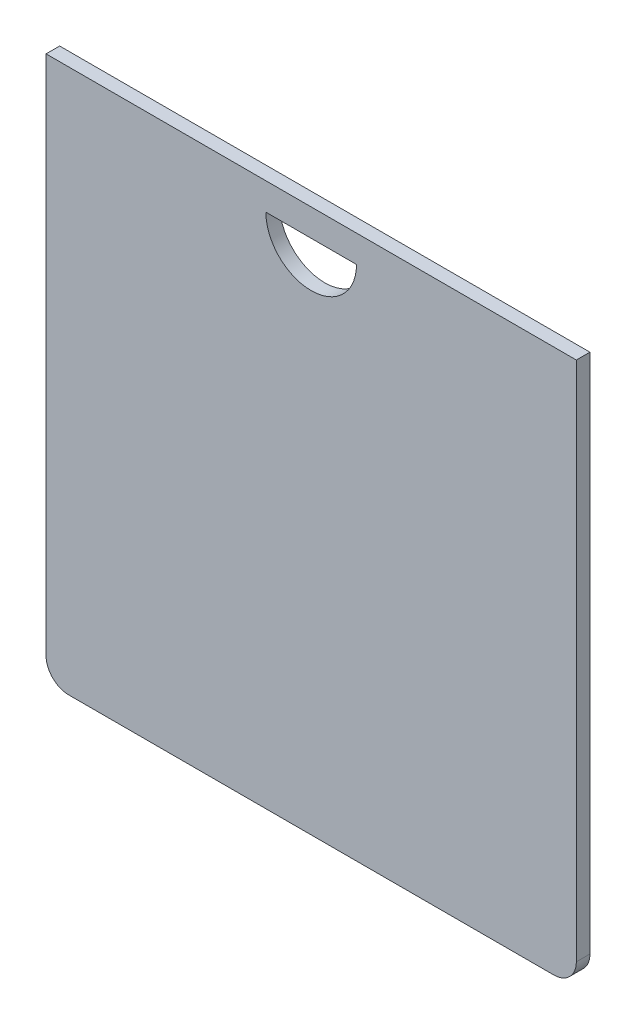
ISO-10303-21;
HEADER;
FILE_DESCRIPTION(('STEP AP214'),'2;1');
FILE_NAME('part.step','',(''),(''),'','','');
FILE_SCHEMA(('AUTOMOTIVE_DESIGN { 1 0 10303 214 1 1 1 1 }'));
ENDSEC;
DATA;
#1=APPLICATION_CONTEXT('core data for automotive mechanical design processes');
#2=APPLICATION_PROTOCOL_DEFINITION('international standard','automotive_design',2000,#1);
#3=PRODUCT_CONTEXT('',#1,'mechanical');
#4=PRODUCT('Part','Part','',(#3));
#5=PRODUCT_RELATED_PRODUCT_CATEGORY('part','',(#4));
#6=PRODUCT_DEFINITION_FORMATION('','',#4);
#7=PRODUCT_DEFINITION_CONTEXT('part definition',#1,'design');
#8=PRODUCT_DEFINITION('design','',#6,#7);
#9=PRODUCT_DEFINITION_SHAPE('','',#8);
#10=(LENGTH_UNIT() NAMED_UNIT(*) SI_UNIT(.MILLI.,.METRE.));
#11=(NAMED_UNIT(*) PLANE_ANGLE_UNIT() SI_UNIT($,.RADIAN.));
#12=(NAMED_UNIT(*) SI_UNIT($,.STERADIAN.) SOLID_ANGLE_UNIT());
#13=UNCERTAINTY_MEASURE_WITH_UNIT(LENGTH_MEASURE(1.E-05),#10,'distance_accuracy_value','');
#14=(GEOMETRIC_REPRESENTATION_CONTEXT(3) GLOBAL_UNCERTAINTY_ASSIGNED_CONTEXT((#13)) GLOBAL_UNIT_ASSIGNED_CONTEXT((#10,
#11,#12)) REPRESENTATION_CONTEXT('',''));
#15=CARTESIAN_POINT('',(0.,0.,0.));
#16=DIRECTION('',(0.,0.,1.));
#17=DIRECTION('',(1.,0.,0.));
#18=AXIS2_PLACEMENT_3D('',#15,#16,#17);
#19=CARTESIAN_POINT('',(0.,60.,1.5));
#20=DIRECTION('',(1.,0.,0.));
#21=DIRECTION('',(0.,1.,0.));
#22=AXIS2_PLACEMENT_3D('',#19,#20,#21);
#23=PLANE('',#22);
#24=DIRECTION('',(0.,-1.,0.));
#25=VECTOR('',#24,1.);
#26=CARTESIAN_POINT('',(0.,60.,0.));
#27=LINE('',#26,#25);
#28=CARTESIAN_POINT('',(0.,60.,0.));
#29=VERTEX_POINT('',#28);
#30=CARTESIAN_POINT('',(0.,2.5,0.));
#31=VERTEX_POINT('',#30);
#32=EDGE_CURVE('E113',#29,#31,#27,.T.);
#33=ORIENTED_EDGE('',*,*,#32,.T.);
#34=DIRECTION('',(0.,0.,-1.));
#35=VECTOR('',#34,1.);
#36=CARTESIAN_POINT('',(0.,2.5,1.5));
#37=LINE('',#36,#35);
#38=CARTESIAN_POINT('',(0.,2.5,1.5));
#39=VERTEX_POINT('',#38);
#40=EDGE_CURVE('E11',#31,#39,#37,.F.);
#41=ORIENTED_EDGE('',*,*,#40,.T.);
#42=DIRECTION('',(0.,-1.,0.));
#43=VECTOR('',#42,1.);
#44=CARTESIAN_POINT('',(0.,60.,1.5));
#45=LINE('',#44,#43);
#46=CARTESIAN_POINT('',(0.,60.,1.5));
#47=VERTEX_POINT('',#46);
#48=EDGE_CURVE('E115',#47,#39,#45,.T.);
#49=ORIENTED_EDGE('',*,*,#48,.F.);
#50=DIRECTION('',(0.,0.,-1.));
#51=VECTOR('',#50,1.);
#52=CARTESIAN_POINT('',(0.,60.,1.5));
#53=LINE('',#52,#51);
#54=EDGE_CURVE('E126',#47,#29,#53,.T.);
#55=ORIENTED_EDGE('',*,*,#54,.T.);
#56=EDGE_LOOP('',(#33,#41,#49,#55));
#57=FACE_BOUND('',#56,.T.);
#58=ADVANCED_FACE('F33',(#57),#23,.F.);
#59=CARTESIAN_POINT('',(0.,0.,1.5));
#60=DIRECTION('',(0.,1.,0.));
#61=DIRECTION('',(0.,0.,1.));
#62=AXIS2_PLACEMENT_3D('',#59,#60,#61);
#63=PLANE('',#62);
#64=DIRECTION('',(1.,0.,0.));
#65=VECTOR('',#64,1.);
#66=CARTESIAN_POINT('',(0.,0.,0.));
#67=LINE('',#66,#65);
#68=CARTESIAN_POINT('',(2.5,0.,0.));
#69=VERTEX_POINT('',#68);
#70=CARTESIAN_POINT('',(56.,0.,0.));
#71=VERTEX_POINT('',#70);
#72=EDGE_CURVE('E129',#69,#71,#67,.T.);
#73=ORIENTED_EDGE('',*,*,#72,.T.);
#74=DIRECTION('',(0.,0.,-1.));
#75=VECTOR('',#74,1.);
#76=CARTESIAN_POINT('',(56.,0.,1.5));
#77=LINE('',#76,#75);
#78=CARTESIAN_POINT('',(56.,0.,1.5));
#79=VERTEX_POINT('',#78);
#80=EDGE_CURVE('E150',#71,#79,#77,.F.);
#81=ORIENTED_EDGE('',*,*,#80,.T.);
#82=DIRECTION('',(1.,0.,0.));
#83=VECTOR('',#82,1.);
#84=CARTESIAN_POINT('',(0.,0.,1.5));
#85=LINE('',#84,#83);
#86=CARTESIAN_POINT('',(2.5,0.,1.5));
#87=VERTEX_POINT('',#86);
#88=EDGE_CURVE('E118',#87,#79,#85,.T.);
#89=ORIENTED_EDGE('',*,*,#88,.F.);
#90=DIRECTION('',(0.,0.,-1.));
#91=VECTOR('',#90,1.);
#92=CARTESIAN_POINT('',(2.5,0.,1.5));
#93=LINE('',#92,#91);
#94=EDGE_CURVE('E147',#87,#69,#93,.T.);
#95=ORIENTED_EDGE('',*,*,#94,.T.);
#96=EDGE_LOOP('',(#73,#81,#89,#95));
#97=FACE_BOUND('',#96,.T.);
#98=ADVANCED_FACE('F170',(#97),#63,.F.);
#99=CARTESIAN_POINT('',(58.5,60.,1.5));
#100=DIRECTION('',(-1.,0.,0.));
#101=DIRECTION('',(0.,-1.,0.));
#102=AXIS2_PLACEMENT_3D('',#99,#100,#101);
#103=PLANE('',#102);
#104=DIRECTION('',(0.,1.,0.));
#105=VECTOR('',#104,1.);
#106=CARTESIAN_POINT('',(58.5,60.,1.5));
#107=LINE('',#106,#105);
#108=CARTESIAN_POINT('',(58.5,2.5,1.5));
#109=VERTEX_POINT('',#108);
#110=CARTESIAN_POINT('',(58.5,60.,1.5));
#111=VERTEX_POINT('',#110);
#112=EDGE_CURVE('E122',#109,#111,#107,.T.);
#113=ORIENTED_EDGE('',*,*,#112,.F.);
#114=DIRECTION('',(0.,0.,-1.));
#115=VECTOR('',#114,1.);
#116=CARTESIAN_POINT('',(58.5,2.5,1.5));
#117=LINE('',#116,#115);
#118=CARTESIAN_POINT('',(58.5,2.5,0.));
#119=VERTEX_POINT('',#118);
#120=EDGE_CURVE('E140',#109,#119,#117,.T.);
#121=ORIENTED_EDGE('',*,*,#120,.T.);
#122=DIRECTION('',(0.,1.,0.));
#123=VECTOR('',#122,1.);
#124=CARTESIAN_POINT('',(58.5,60.,0.));
#125=LINE('',#124,#123);
#126=CARTESIAN_POINT('',(58.5,60.,0.));
#127=VERTEX_POINT('',#126);
#128=EDGE_CURVE('E132',#119,#127,#125,.T.);
#129=ORIENTED_EDGE('',*,*,#128,.T.);
#130=DIRECTION('',(0.,0.,-1.));
#131=VECTOR('',#130,1.);
#132=CARTESIAN_POINT('',(58.5,60.,1.5));
#133=LINE('',#132,#131);
#134=EDGE_CURVE('E137',#111,#127,#133,.T.);
#135=ORIENTED_EDGE('',*,*,#134,.F.);
#136=EDGE_LOOP('',(#113,#121,#129,#135));
#137=FACE_BOUND('',#136,.T.);
#138=ADVANCED_FACE('F163',(#137),#103,.F.);
#139=CARTESIAN_POINT('',(0.,60.,1.5));
#140=DIRECTION('',(0.,-1.,0.));
#141=DIRECTION('',(0.,0.,-1.));
#142=AXIS2_PLACEMENT_3D('',#139,#140,#141);
#143=PLANE('',#142);
#144=DIRECTION('',(-1.,0.,0.));
#145=VECTOR('',#144,1.);
#146=CARTESIAN_POINT('',(0.,60.,0.));
#147=LINE('',#146,#145);
#148=EDGE_CURVE('E119',#127,#29,#147,.T.);
#149=ORIENTED_EDGE('',*,*,#148,.T.);
#150=ORIENTED_EDGE('',*,*,#54,.F.);
#151=DIRECTION('',(-1.,0.,0.));
#152=VECTOR('',#151,1.);
#153=CARTESIAN_POINT('',(0.,60.,1.5));
#154=LINE('',#153,#152);
#155=EDGE_CURVE('E124',#111,#47,#154,.T.);
#156=ORIENTED_EDGE('',*,*,#155,.F.);
#157=ORIENTED_EDGE('',*,*,#134,.T.);
#158=EDGE_LOOP('',(#149,#150,#156,#157));
#159=FACE_BOUND('',#158,.T.);
#160=ADVANCED_FACE('F180',(#159),#143,.F.);
#161=CARTESIAN_POINT('',(0.,0.,1.5));
#162=DIRECTION('',(0.,0.,1.));
#163=DIRECTION('',(1.,0.,0.));
#164=AXIS2_PLACEMENT_3D('',#161,#162,#163);
#165=PLANE('',#164);
#166=CARTESIAN_POINT('',(29.25,57.,1.5));
#167=DIRECTION('',(0.,0.,1.));
#168=DIRECTION('',(1.,0.,0.));
#169=AXIS2_PLACEMENT_3D('',#166,#167,#168);
#170=CIRCLE('',#169,5.);
#171=CARTESIAN_POINT('',(24.25,57.,1.5));
#172=VERTEX_POINT('',#171);
#173=CARTESIAN_POINT('',(34.25,57.,1.5));
#174=VERTEX_POINT('',#173);
#175=EDGE_CURVE('E48',#172,#174,#170,.T.);
#176=ORIENTED_EDGE('',*,*,#175,.F.);
#177=DIRECTION('',(-1.,0.,0.));
#178=VECTOR('',#177,1.);
#179=CARTESIAN_POINT('',(24.25,57.,1.5));
#180=LINE('',#179,#178);
#181=EDGE_CURVE('E108',#174,#172,#180,.T.);
#182=ORIENTED_EDGE('',*,*,#181,.F.);
#183=EDGE_LOOP('',(#176,#182));
#184=FACE_BOUND('',#183,.T.);
#185=ORIENTED_EDGE('',*,*,#88,.T.);
#186=CARTESIAN_POINT('',(56.,2.5,1.5));
#187=DIRECTION('',(0.,0.,1.));
#188=DIRECTION('',(1.,0.,0.));
#189=AXIS2_PLACEMENT_3D('',#186,#187,#188);
#190=CIRCLE('',#189,2.5);
#191=EDGE_CURVE('E41',#79,#109,#190,.T.);
#192=ORIENTED_EDGE('',*,*,#191,.T.);
#193=ORIENTED_EDGE('',*,*,#112,.T.);
#194=ORIENTED_EDGE('',*,*,#155,.T.);
#195=ORIENTED_EDGE('',*,*,#48,.T.);
#196=CARTESIAN_POINT('',(2.5,2.5,1.5));
#197=DIRECTION('',(0.,0.,1.));
#198=DIRECTION('',(1.,0.,0.));
#199=AXIS2_PLACEMENT_3D('',#196,#197,#198);
#200=CIRCLE('',#199,2.5);
#201=EDGE_CURVE('E152',#39,#87,#200,.T.);
#202=ORIENTED_EDGE('',*,*,#201,.T.);
#203=EDGE_LOOP('',(#185,#192,#193,#194,#195,#202));
#204=FACE_BOUND('',#203,.T.);
#205=ADVANCED_FACE('F156',(#184,#204),#165,.T.);
#206=CARTESIAN_POINT('',(0.,0.,0.));
#207=DIRECTION('',(0.,0.,1.));
#208=DIRECTION('',(1.,0.,0.));
#209=AXIS2_PLACEMENT_3D('',#206,#207,#208);
#210=PLANE('',#209);
#211=DIRECTION('',(-1.,0.,0.));
#212=VECTOR('',#211,1.);
#213=CARTESIAN_POINT('',(24.25,57.,0.));
#214=LINE('',#213,#212);
#215=CARTESIAN_POINT('',(34.25,57.,0.));
#216=VERTEX_POINT('',#215);
#217=CARTESIAN_POINT('',(24.25,57.,0.));
#218=VERTEX_POINT('',#217);
#219=EDGE_CURVE('E100',#216,#218,#214,.T.);
#220=ORIENTED_EDGE('',*,*,#219,.T.);
#221=CARTESIAN_POINT('',(29.25,57.,0.));
#222=DIRECTION('',(0.,0.,1.));
#223=DIRECTION('',(1.,0.,0.));
#224=AXIS2_PLACEMENT_3D('',#221,#222,#223);
#225=CIRCLE('',#224,5.);
#226=EDGE_CURVE('E53',#218,#216,#225,.T.);
#227=ORIENTED_EDGE('',*,*,#226,.T.);
#228=EDGE_LOOP('',(#220,#227));
#229=FACE_BOUND('',#228,.T.);
#230=ORIENTED_EDGE('',*,*,#128,.F.);
#231=CARTESIAN_POINT('',(56.,2.5,0.));
#232=DIRECTION('',(0.,0.,1.));
#233=DIRECTION('',(1.,0.,0.));
#234=AXIS2_PLACEMENT_3D('',#231,#232,#233);
#235=CIRCLE('',#234,2.5);
#236=EDGE_CURVE('E145',#119,#71,#235,.F.);
#237=ORIENTED_EDGE('',*,*,#236,.T.);
#238=ORIENTED_EDGE('',*,*,#72,.F.);
#239=CARTESIAN_POINT('',(2.5,2.5,0.));
#240=DIRECTION('',(0.,0.,1.));
#241=DIRECTION('',(1.,0.,0.));
#242=AXIS2_PLACEMENT_3D('',#239,#240,#241);
#243=CIRCLE('',#242,2.5);
#244=EDGE_CURVE('E143',#69,#31,#243,.F.);
#245=ORIENTED_EDGE('',*,*,#244,.T.);
#246=ORIENTED_EDGE('',*,*,#32,.F.);
#247=ORIENTED_EDGE('',*,*,#148,.F.);
#248=EDGE_LOOP('',(#230,#237,#238,#245,#246,#247));
#249=FACE_BOUND('',#248,.T.);
#250=ADVANCED_FACE('F106',(#229,#249),#210,.F.);
#251=CARTESIAN_POINT('',(56.,2.5,1.5));
#252=DIRECTION('',(0.,0.,-1.));
#253=DIRECTION('',(-1.,0.,0.));
#254=AXIS2_PLACEMENT_3D('',#251,#252,#253);
#255=CYLINDRICAL_SURFACE('',#254,2.5);
#256=ORIENTED_EDGE('',*,*,#191,.F.);
#257=ORIENTED_EDGE('',*,*,#80,.F.);
#258=ORIENTED_EDGE('',*,*,#236,.F.);
#259=ORIENTED_EDGE('',*,*,#120,.F.);
#260=EDGE_LOOP('',(#256,#257,#258,#259));
#261=FACE_BOUND('',#260,.T.);
#262=ADVANCED_FACE('F166',(#261),#255,.T.);
#263=CARTESIAN_POINT('',(2.5,2.5,1.5));
#264=DIRECTION('',(0.,0.,-1.));
#265=DIRECTION('',(-1.,0.,0.));
#266=AXIS2_PLACEMENT_3D('',#263,#264,#265);
#267=CYLINDRICAL_SURFACE('',#266,2.5);
#268=ORIENTED_EDGE('',*,*,#201,.F.);
#269=ORIENTED_EDGE('',*,*,#40,.F.);
#270=ORIENTED_EDGE('',*,*,#244,.F.);
#271=ORIENTED_EDGE('',*,*,#94,.F.);
#272=EDGE_LOOP('',(#268,#269,#270,#271));
#273=FACE_BOUND('',#272,.T.);
#274=ADVANCED_FACE('F35',(#273),#267,.T.);
#275=CARTESIAN_POINT('',(29.25,57.,0.));
#276=DIRECTION('',(0.,0.,1.));
#277=DIRECTION('',(1.,0.,0.));
#278=AXIS2_PLACEMENT_3D('',#275,#276,#277);
#279=CYLINDRICAL_SURFACE('',#278,5.);
#280=ORIENTED_EDGE('',*,*,#175,.T.);
#281=DIRECTION('',(0.,0.,1.));
#282=VECTOR('',#281,1.);
#283=CARTESIAN_POINT('',(34.25,57.,0.));
#284=LINE('',#283,#282);
#285=EDGE_CURVE('E93',#216,#174,#284,.T.);
#286=ORIENTED_EDGE('',*,*,#285,.F.);
#287=ORIENTED_EDGE('',*,*,#226,.F.);
#288=DIRECTION('',(0.,0.,1.));
#289=VECTOR('',#288,1.);
#290=CARTESIAN_POINT('',(24.25,57.,0.));
#291=LINE('',#290,#289);
#292=EDGE_CURVE('E99',#218,#172,#291,.T.);
#293=ORIENTED_EDGE('',*,*,#292,.T.);
#294=EDGE_LOOP('',(#280,#286,#287,#293));
#295=FACE_BOUND('',#294,.T.);
#296=ADVANCED_FACE('F95',(#295),#279,.F.);
#297=CARTESIAN_POINT('',(24.25,57.,0.));
#298=DIRECTION('',(0.,1.,0.));
#299=DIRECTION('',(0.,0.,1.));
#300=AXIS2_PLACEMENT_3D('',#297,#298,#299);
#301=PLANE('',#300);
#302=ORIENTED_EDGE('',*,*,#181,.T.);
#303=ORIENTED_EDGE('',*,*,#292,.F.);
#304=ORIENTED_EDGE('',*,*,#219,.F.);
#305=ORIENTED_EDGE('',*,*,#285,.T.);
#306=EDGE_LOOP('',(#302,#303,#304,#305));
#307=FACE_BOUND('',#306,.T.);
#308=ADVANCED_FACE('F103',(#307),#301,.F.);
#309=CLOSED_SHELL('',(#58,#98,#138,#160,#205,#250,#262,#274,#296,#308));
#310=MANIFOLD_SOLID_BREP('B2',#309);
#311=ADVANCED_BREP_SHAPE_REPRESENTATION('',(#18,#310),#14);
#312=SHAPE_DEFINITION_REPRESENTATION(#9,#311);
ENDSEC;
END-ISO-10303-21;
